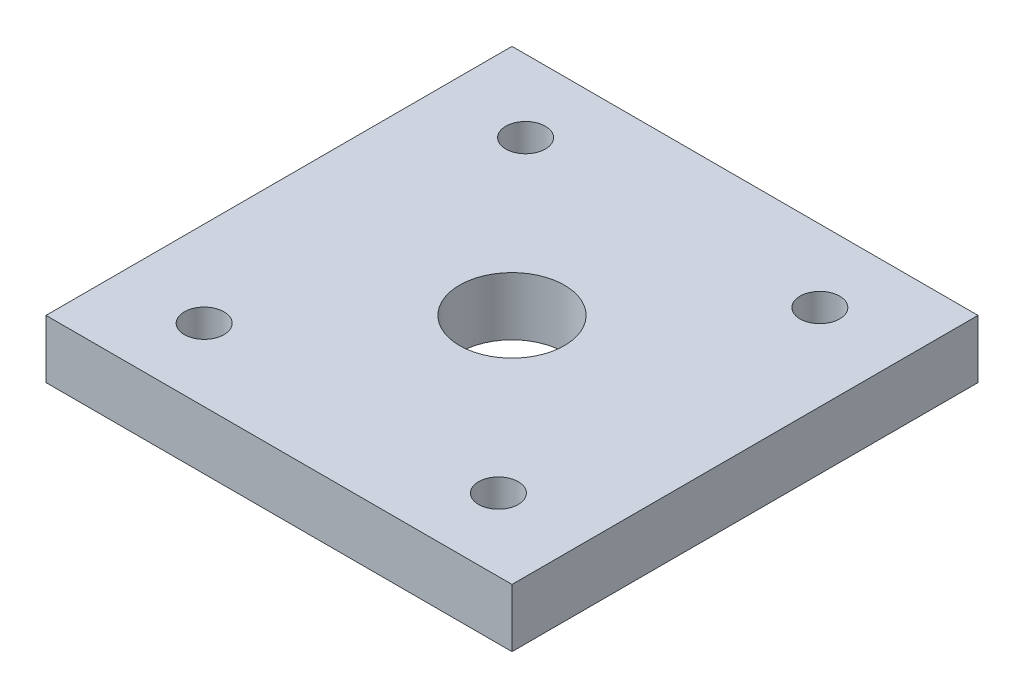
ISO-10303-21;
HEADER;
FILE_DESCRIPTION(('STEP AP214'),'2;1');
FILE_NAME('part.step','',(''),(''),'','','');
FILE_SCHEMA(('AUTOMOTIVE_DESIGN { 1 0 10303 214 1 1 1 1 }'));
ENDSEC;
DATA;
#1=APPLICATION_CONTEXT('core data for automotive mechanical design processes');
#2=APPLICATION_PROTOCOL_DEFINITION('international standard','automotive_design',2000,#1);
#3=PRODUCT_CONTEXT('',#1,'mechanical');
#4=PRODUCT('Part','Part','',(#3));
#5=PRODUCT_RELATED_PRODUCT_CATEGORY('part','',(#4));
#6=PRODUCT_DEFINITION_FORMATION('','',#4);
#7=PRODUCT_DEFINITION_CONTEXT('part definition',#1,'design');
#8=PRODUCT_DEFINITION('design','',#6,#7);
#9=PRODUCT_DEFINITION_SHAPE('','',#8);
#10=(LENGTH_UNIT() NAMED_UNIT(*) SI_UNIT(.MILLI.,.METRE.));
#11=(NAMED_UNIT(*) PLANE_ANGLE_UNIT() SI_UNIT($,.RADIAN.));
#12=(NAMED_UNIT(*) SI_UNIT($,.STERADIAN.) SOLID_ANGLE_UNIT());
#13=UNCERTAINTY_MEASURE_WITH_UNIT(LENGTH_MEASURE(1.E-05),#10,'distance_accuracy_value','');
#14=(GEOMETRIC_REPRESENTATION_CONTEXT(3) GLOBAL_UNCERTAINTY_ASSIGNED_CONTEXT((#13)) GLOBAL_UNIT_ASSIGNED_CONTEXT((#10,
#11,#12)) REPRESENTATION_CONTEXT('',''));
#15=CARTESIAN_POINT('',(0.,0.,0.));
#16=DIRECTION('',(0.,0.,1.));
#17=DIRECTION('',(1.,0.,0.));
#18=AXIS2_PLACEMENT_3D('',#15,#16,#17);
#19=CARTESIAN_POINT('',(0.,5.,0.));
#20=DIRECTION('',(0.,1.,0.));
#21=DIRECTION('',(0.,0.,1.));
#22=AXIS2_PLACEMENT_3D('',#19,#20,#21);
#23=PLANE('',#22);
#24=CARTESIAN_POINT('',(-12.6287568126646,5.,-13.7952831247367));
#25=DIRECTION('',(0.,1.,0.));
#26=DIRECTION('',(0.,0.,1.));
#27=AXIS2_PLACEMENT_3D('',#24,#25,#26);
#28=CIRCLE('',#27,1.7);
#29=CARTESIAN_POINT('',(-12.6287568126646,5.,-12.0952831247367));
#30=VERTEX_POINT('',#29);
#31=EDGE_CURVE('E127',#30,#30,#28,.T.);
#32=ORIENTED_EDGE('',*,*,#31,.F.);
#33=EDGE_LOOP('',(#32));
#34=FACE_BOUND('',#33,.T.);
#35=CARTESIAN_POINT('',(-12.6287568126646,5.,13.7952831247364));
#36=DIRECTION('',(0.,1.,0.));
#37=DIRECTION('',(0.,0.,1.));
#38=AXIS2_PLACEMENT_3D('',#35,#36,#37);
#39=CIRCLE('',#38,1.7);
#40=CARTESIAN_POINT('',(-12.6287568126646,5.,15.4952831247364));
#41=VERTEX_POINT('',#40);
#42=EDGE_CURVE('E132',#41,#41,#39,.T.);
#43=ORIENTED_EDGE('',*,*,#42,.F.);
#44=EDGE_LOOP('',(#43));
#45=FACE_BOUND('',#44,.T.);
#46=CARTESIAN_POINT('',(12.6287568126646,5.,13.7952831247364));
#47=DIRECTION('',(0.,1.,0.));
#48=DIRECTION('',(0.,0.,1.));
#49=AXIS2_PLACEMENT_3D('',#46,#47,#48);
#50=CIRCLE('',#49,1.7);
#51=CARTESIAN_POINT('',(12.6287568126646,5.,15.4952831247364));
#52=VERTEX_POINT('',#51);
#53=EDGE_CURVE('E135',#52,#52,#50,.T.);
#54=ORIENTED_EDGE('',*,*,#53,.F.);
#55=EDGE_LOOP('',(#54));
#56=FACE_BOUND('',#55,.T.);
#57=CARTESIAN_POINT('',(12.6287568126645,5.,-13.7952831247367));
#58=DIRECTION('',(0.,1.,0.));
#59=DIRECTION('',(0.,0.,1.));
#60=AXIS2_PLACEMENT_3D('',#57,#58,#59);
#61=CIRCLE('',#60,1.7);
#62=CARTESIAN_POINT('',(12.6287568126645,5.,-12.0952831247367));
#63=VERTEX_POINT('',#62);
#64=EDGE_CURVE('E138',#63,#63,#61,.T.);
#65=ORIENTED_EDGE('',*,*,#64,.F.);
#66=EDGE_LOOP('',(#65));
#67=FACE_BOUND('',#66,.T.);
#68=DIRECTION('',(0.,0.,-1.));
#69=VECTOR('',#68,1.);
#70=CARTESIAN_POINT('',(20.,5.,-20.));
#71=LINE('',#70,#69);
#72=CARTESIAN_POINT('',(20.,5.,20.));
#73=VERTEX_POINT('',#72);
#74=CARTESIAN_POINT('',(20.,5.,-20.));
#75=VERTEX_POINT('',#74);
#76=EDGE_CURVE('E97',#73,#75,#71,.T.);
#77=ORIENTED_EDGE('',*,*,#76,.T.);
#78=DIRECTION('',(-1.,0.,0.));
#79=VECTOR('',#78,1.);
#80=CARTESIAN_POINT('',(-20.,5.,-20.));
#81=LINE('',#80,#79);
#82=CARTESIAN_POINT('',(-20.,5.,-20.));
#83=VERTEX_POINT('',#82);
#84=EDGE_CURVE('E92',#75,#83,#81,.T.);
#85=ORIENTED_EDGE('',*,*,#84,.T.);
#86=DIRECTION('',(0.,0.,1.));
#87=VECTOR('',#86,1.);
#88=CARTESIAN_POINT('',(-20.,5.,-20.));
#89=LINE('',#88,#87);
#90=CARTESIAN_POINT('',(-20.,5.,20.));
#91=VERTEX_POINT('',#90);
#92=EDGE_CURVE('E95',#83,#91,#89,.T.);
#93=ORIENTED_EDGE('',*,*,#92,.T.);
#94=DIRECTION('',(1.,0.,0.));
#95=VECTOR('',#94,1.);
#96=CARTESIAN_POINT('',(-20.,5.,20.));
#97=LINE('',#96,#95);
#98=EDGE_CURVE('E62',#91,#73,#97,.T.);
#99=ORIENTED_EDGE('',*,*,#98,.T.);
#100=EDGE_LOOP('',(#77,#85,#93,#99));
#101=FACE_BOUND('',#100,.T.);
#102=CARTESIAN_POINT('',(0.,5.,0.));
#103=DIRECTION('',(0.,1.,0.));
#104=DIRECTION('',(0.,0.,1.));
#105=AXIS2_PLACEMENT_3D('',#102,#103,#104);
#106=CIRCLE('',#105,4.5);
#107=CARTESIAN_POINT('',(0.,5.,4.5));
#108=VERTEX_POINT('',#107);
#109=EDGE_CURVE('E112',#108,#108,#106,.T.);
#110=ORIENTED_EDGE('',*,*,#109,.F.);
#111=EDGE_LOOP('',(#110));
#112=FACE_BOUND('',#111,.T.);
#113=ADVANCED_FACE('F45',(#34,#45,#56,#67,#101,#112),#23,.T.);
#114=CARTESIAN_POINT('',(0.,0.,0.));
#115=DIRECTION('',(0.,1.,0.));
#116=DIRECTION('',(0.,0.,1.));
#117=AXIS2_PLACEMENT_3D('',#114,#115,#116);
#118=PLANE('',#117);
#119=CARTESIAN_POINT('',(-12.6287568126646,0.,-13.7952831247367));
#120=DIRECTION('',(0.,-1.,0.));
#121=DIRECTION('',(0.,0.,-1.));
#122=AXIS2_PLACEMENT_3D('',#119,#120,#121);
#123=CIRCLE('',#122,1.7);
#124=CARTESIAN_POINT('',(-12.6287568126646,0.,-15.4952831247367));
#125=VERTEX_POINT('',#124);
#126=EDGE_CURVE('E145',#125,#125,#123,.T.);
#127=ORIENTED_EDGE('',*,*,#126,.F.);
#128=EDGE_LOOP('',(#127));
#129=FACE_BOUND('',#128,.T.);
#130=CARTESIAN_POINT('',(-12.6287568126646,0.,13.7952831247364));
#131=DIRECTION('',(0.,-1.,0.));
#132=DIRECTION('',(0.,0.,-1.));
#133=AXIS2_PLACEMENT_3D('',#130,#131,#132);
#134=CIRCLE('',#133,1.7);
#135=CARTESIAN_POINT('',(-12.6287568126646,0.,12.0952831247364));
#136=VERTEX_POINT('',#135);
#137=EDGE_CURVE('E148',#136,#136,#134,.T.);
#138=ORIENTED_EDGE('',*,*,#137,.F.);
#139=EDGE_LOOP('',(#138));
#140=FACE_BOUND('',#139,.T.);
#141=CARTESIAN_POINT('',(12.6287568126646,0.,13.7952831247364));
#142=DIRECTION('',(0.,-1.,0.));
#143=DIRECTION('',(0.,0.,-1.));
#144=AXIS2_PLACEMENT_3D('',#141,#142,#143);
#145=CIRCLE('',#144,1.7);
#146=CARTESIAN_POINT('',(12.6287568126646,0.,12.0952831247364));
#147=VERTEX_POINT('',#146);
#148=EDGE_CURVE('E144',#147,#147,#145,.T.);
#149=ORIENTED_EDGE('',*,*,#148,.F.);
#150=EDGE_LOOP('',(#149));
#151=FACE_BOUND('',#150,.T.);
#152=CARTESIAN_POINT('',(12.6287568126645,0.,-13.7952831247367));
#153=DIRECTION('',(0.,-1.,0.));
#154=DIRECTION('',(0.,0.,-1.));
#155=AXIS2_PLACEMENT_3D('',#152,#153,#154);
#156=CIRCLE('',#155,1.7);
#157=CARTESIAN_POINT('',(12.6287568126645,0.,-15.4952831247367));
#158=VERTEX_POINT('',#157);
#159=EDGE_CURVE('E141',#158,#158,#156,.T.);
#160=ORIENTED_EDGE('',*,*,#159,.F.);
#161=EDGE_LOOP('',(#160));
#162=FACE_BOUND('',#161,.T.);
#163=DIRECTION('',(0.,0.,-1.));
#164=VECTOR('',#163,1.);
#165=CARTESIAN_POINT('',(20.,0.,-20.));
#166=LINE('',#165,#164);
#167=CARTESIAN_POINT('',(20.,0.,20.));
#168=VERTEX_POINT('',#167);
#169=CARTESIAN_POINT('',(20.,0.,-20.));
#170=VERTEX_POINT('',#169);
#171=EDGE_CURVE('E109',#168,#170,#166,.T.);
#172=ORIENTED_EDGE('',*,*,#171,.F.);
#173=DIRECTION('',(1.,0.,0.));
#174=VECTOR('',#173,1.);
#175=CARTESIAN_POINT('',(-20.,0.,20.));
#176=LINE('',#175,#174);
#177=CARTESIAN_POINT('',(-20.,0.,20.));
#178=VERTEX_POINT('',#177);
#179=EDGE_CURVE('E85',#178,#168,#176,.T.);
#180=ORIENTED_EDGE('',*,*,#179,.F.);
#181=DIRECTION('',(0.,0.,1.));
#182=VECTOR('',#181,1.);
#183=CARTESIAN_POINT('',(-20.,0.,-20.));
#184=LINE('',#183,#182);
#185=CARTESIAN_POINT('',(-20.,0.,-20.));
#186=VERTEX_POINT('',#185);
#187=EDGE_CURVE('E79',#186,#178,#184,.T.);
#188=ORIENTED_EDGE('',*,*,#187,.F.);
#189=DIRECTION('',(-1.,0.,0.));
#190=VECTOR('',#189,1.);
#191=CARTESIAN_POINT('',(-20.,0.,-20.));
#192=LINE('',#191,#190);
#193=EDGE_CURVE('E101',#170,#186,#192,.T.);
#194=ORIENTED_EDGE('',*,*,#193,.F.);
#195=EDGE_LOOP('',(#172,#180,#188,#194));
#196=FACE_BOUND('',#195,.T.);
#197=CARTESIAN_POINT('',(0.,0.,0.));
#198=DIRECTION('',(0.,1.,0.));
#199=DIRECTION('',(0.,0.,1.));
#200=AXIS2_PLACEMENT_3D('',#197,#198,#199);
#201=CIRCLE('',#200,4.5);
#202=CARTESIAN_POINT('',(0.,0.,4.5));
#203=VERTEX_POINT('',#202);
#204=EDGE_CURVE('E124',#203,#203,#201,.T.);
#205=ORIENTED_EDGE('',*,*,#204,.T.);
#206=EDGE_LOOP('',(#205));
#207=FACE_BOUND('',#206,.T.);
#208=ADVANCED_FACE('F120',(#129,#140,#151,#162,#196,#207),#118,.F.);
#209=CARTESIAN_POINT('',(20.,5.,-20.));
#210=DIRECTION('',(-1.,0.,0.));
#211=DIRECTION('',(0.,0.,1.));
#212=AXIS2_PLACEMENT_3D('',#209,#210,#211);
#213=PLANE('',#212);
#214=ORIENTED_EDGE('',*,*,#171,.T.);
#215=DIRECTION('',(0.,-1.,0.));
#216=VECTOR('',#215,1.);
#217=CARTESIAN_POINT('',(20.,5.,-20.));
#218=LINE('',#217,#216);
#219=EDGE_CURVE('E11',#75,#170,#218,.T.);
#220=ORIENTED_EDGE('',*,*,#219,.F.);
#221=ORIENTED_EDGE('',*,*,#76,.F.);
#222=DIRECTION('',(0.,-1.,0.));
#223=VECTOR('',#222,1.);
#224=CARTESIAN_POINT('',(20.,5.,20.));
#225=LINE('',#224,#223);
#226=EDGE_CURVE('E105',#73,#168,#225,.T.);
#227=ORIENTED_EDGE('',*,*,#226,.T.);
#228=EDGE_LOOP('',(#214,#220,#221,#227));
#229=FACE_BOUND('',#228,.T.);
#230=ADVANCED_FACE('F47',(#229),#213,.F.);
#231=CARTESIAN_POINT('',(-20.,5.,-20.));
#232=DIRECTION('',(0.,0.,1.));
#233=DIRECTION('',(1.,0.,0.));
#234=AXIS2_PLACEMENT_3D('',#231,#232,#233);
#235=PLANE('',#234);
#236=ORIENTED_EDGE('',*,*,#193,.T.);
#237=DIRECTION('',(0.,-1.,0.));
#238=VECTOR('',#237,1.);
#239=CARTESIAN_POINT('',(-20.,5.,-20.));
#240=LINE('',#239,#238);
#241=EDGE_CURVE('E54',#83,#186,#240,.T.);
#242=ORIENTED_EDGE('',*,*,#241,.F.);
#243=ORIENTED_EDGE('',*,*,#84,.F.);
#244=ORIENTED_EDGE('',*,*,#219,.T.);
#245=EDGE_LOOP('',(#236,#242,#243,#244));
#246=FACE_BOUND('',#245,.T.);
#247=ADVANCED_FACE('F100',(#246),#235,.F.);
#248=CARTESIAN_POINT('',(-20.,5.,-20.));
#249=DIRECTION('',(1.,0.,0.));
#250=DIRECTION('',(0.,0.,-1.));
#251=AXIS2_PLACEMENT_3D('',#248,#249,#250);
#252=PLANE('',#251);
#253=ORIENTED_EDGE('',*,*,#187,.T.);
#254=DIRECTION('',(0.,-1.,0.));
#255=VECTOR('',#254,1.);
#256=CARTESIAN_POINT('',(-20.,5.,20.));
#257=LINE('',#256,#255);
#258=EDGE_CURVE('E102',#91,#178,#257,.T.);
#259=ORIENTED_EDGE('',*,*,#258,.F.);
#260=ORIENTED_EDGE('',*,*,#92,.F.);
#261=ORIENTED_EDGE('',*,*,#241,.T.);
#262=EDGE_LOOP('',(#253,#259,#260,#261));
#263=FACE_BOUND('',#262,.T.);
#264=ADVANCED_FACE('F103',(#263),#252,.F.);
#265=CARTESIAN_POINT('',(-20.,5.,20.));
#266=DIRECTION('',(0.,0.,-1.));
#267=DIRECTION('',(-1.,0.,0.));
#268=AXIS2_PLACEMENT_3D('',#265,#266,#267);
#269=PLANE('',#268);
#270=ORIENTED_EDGE('',*,*,#179,.T.);
#271=ORIENTED_EDGE('',*,*,#226,.F.);
#272=ORIENTED_EDGE('',*,*,#98,.F.);
#273=ORIENTED_EDGE('',*,*,#258,.T.);
#274=EDGE_LOOP('',(#270,#271,#272,#273));
#275=FACE_BOUND('',#274,.T.);
#276=ADVANCED_FACE('F117',(#275),#269,.F.);
#277=CARTESIAN_POINT('',(0.,5.,0.));
#278=DIRECTION('',(0.,-1.,0.));
#279=DIRECTION('',(0.,0.,-1.));
#280=AXIS2_PLACEMENT_3D('',#277,#278,#279);
#281=CYLINDRICAL_SURFACE('',#280,4.5);
#282=ORIENTED_EDGE('',*,*,#109,.T.);
#283=EDGE_LOOP('',(#282));
#284=FACE_BOUND('',#283,.T.);
#285=ORIENTED_EDGE('',*,*,#204,.F.);
#286=EDGE_LOOP('',(#285));
#287=FACE_BOUND('',#286,.T.);
#288=ADVANCED_FACE('F164',(#284,#287),#281,.F.);
#289=CARTESIAN_POINT('',(12.6287568126645,10.,-13.7952831247367));
#290=DIRECTION('',(0.,-1.,0.));
#291=DIRECTION('',(0.,0.,-1.));
#292=AXIS2_PLACEMENT_3D('',#289,#290,#291);
#293=CYLINDRICAL_SURFACE('',#292,1.7);
#294=ORIENTED_EDGE('',*,*,#64,.T.);
#295=EDGE_LOOP('',(#294));
#296=FACE_BOUND('',#295,.T.);
#297=ORIENTED_EDGE('',*,*,#159,.T.);
#298=EDGE_LOOP('',(#297));
#299=FACE_BOUND('',#298,.T.);
#300=ADVANCED_FACE('F162',(#296,#299),#293,.F.);
#301=CARTESIAN_POINT('',(12.6287568126646,10.,13.7952831247364));
#302=DIRECTION('',(0.,-1.,0.));
#303=DIRECTION('',(0.,0.,-1.));
#304=AXIS2_PLACEMENT_3D('',#301,#302,#303);
#305=CYLINDRICAL_SURFACE('',#304,1.7);
#306=ORIENTED_EDGE('',*,*,#53,.T.);
#307=EDGE_LOOP('',(#306));
#308=FACE_BOUND('',#307,.T.);
#309=ORIENTED_EDGE('',*,*,#148,.T.);
#310=EDGE_LOOP('',(#309));
#311=FACE_BOUND('',#310,.T.);
#312=ADVANCED_FACE('F154',(#308,#311),#305,.F.);
#313=CARTESIAN_POINT('',(-12.6287568126646,10.,13.7952831247364));
#314=DIRECTION('',(0.,-1.,0.));
#315=DIRECTION('',(0.,0.,-1.));
#316=AXIS2_PLACEMENT_3D('',#313,#314,#315);
#317=CYLINDRICAL_SURFACE('',#316,1.7);
#318=ORIENTED_EDGE('',*,*,#42,.T.);
#319=EDGE_LOOP('',(#318));
#320=FACE_BOUND('',#319,.T.);
#321=ORIENTED_EDGE('',*,*,#137,.T.);
#322=EDGE_LOOP('',(#321));
#323=FACE_BOUND('',#322,.T.);
#324=ADVANCED_FACE('F170',(#320,#323),#317,.F.);
#325=CARTESIAN_POINT('',(-12.6287568126646,10.,-13.7952831247367));
#326=DIRECTION('',(0.,-1.,0.));
#327=DIRECTION('',(0.,0.,-1.));
#328=AXIS2_PLACEMENT_3D('',#325,#326,#327);
#329=CYLINDRICAL_SURFACE('',#328,1.7);
#330=ORIENTED_EDGE('',*,*,#31,.T.);
#331=EDGE_LOOP('',(#330));
#332=FACE_BOUND('',#331,.T.);
#333=ORIENTED_EDGE('',*,*,#126,.T.);
#334=EDGE_LOOP('',(#333));
#335=FACE_BOUND('',#334,.T.);
#336=ADVANCED_FACE('F240',(#332,#335),#329,.F.);
#337=CLOSED_SHELL('',(#113,#208,#230,#247,#264,#276,#288,#300,#312,#324,#336));
#338=MANIFOLD_SOLID_BREP('B2',#337);
#339=ADVANCED_BREP_SHAPE_REPRESENTATION('',(#18,#338),#14);
#340=SHAPE_DEFINITION_REPRESENTATION(#9,#339);
ENDSEC;
END-ISO-10303-21;
